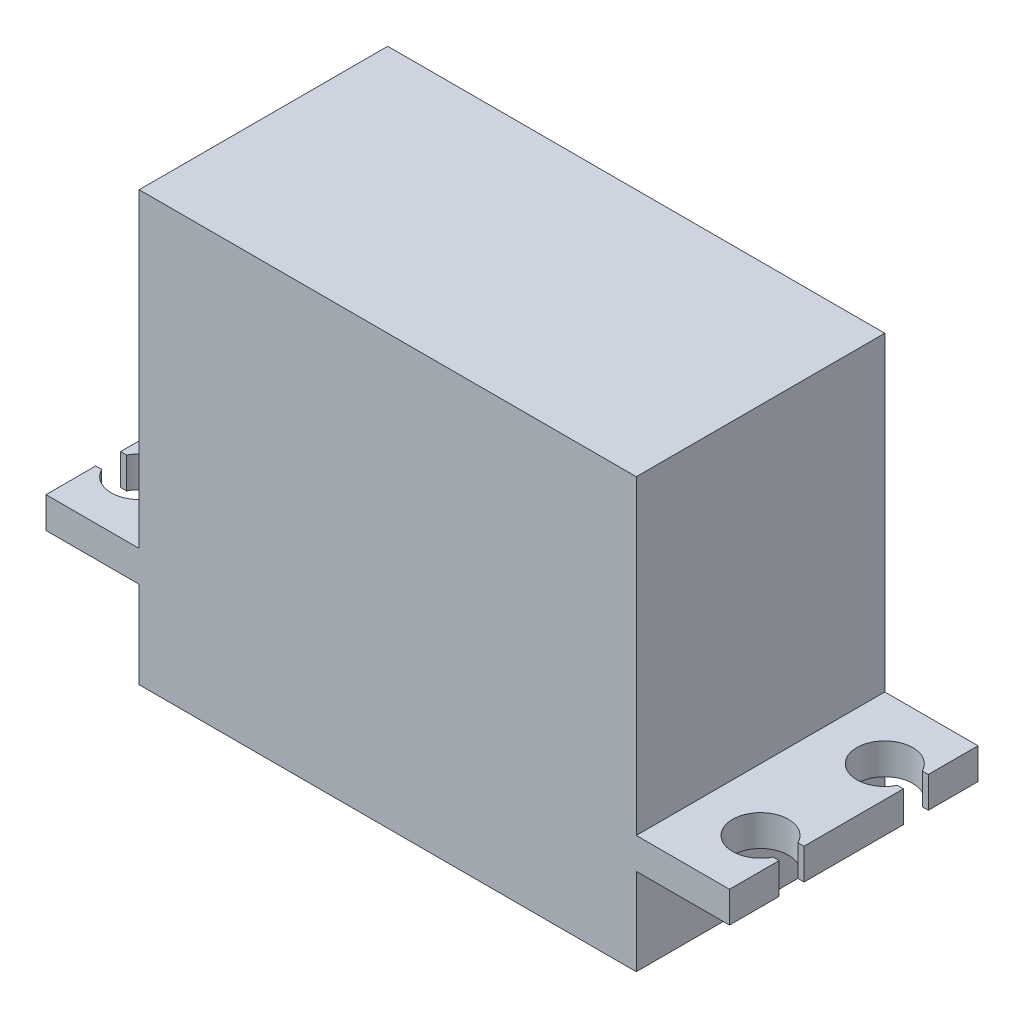
ISO-10303-21;
HEADER;
FILE_DESCRIPTION(('STEP AP214'),'2;1');
FILE_NAME('part.step','',(''),(''),'','','');
FILE_SCHEMA(('AUTOMOTIVE_DESIGN { 1 0 10303 214 1 1 1 1 }'));
ENDSEC;
DATA;
#1=APPLICATION_CONTEXT('core data for automotive mechanical design processes');
#2=APPLICATION_PROTOCOL_DEFINITION('international standard','automotive_design',2000,#1);
#3=PRODUCT_CONTEXT('',#1,'mechanical');
#4=PRODUCT('Part','Part','',(#3));
#5=PRODUCT_RELATED_PRODUCT_CATEGORY('part','',(#4));
#6=PRODUCT_DEFINITION_FORMATION('','',#4);
#7=PRODUCT_DEFINITION_CONTEXT('part definition',#1,'design');
#8=PRODUCT_DEFINITION('design','',#6,#7);
#9=PRODUCT_DEFINITION_SHAPE('','',#8);
#10=(LENGTH_UNIT() NAMED_UNIT(*) SI_UNIT(.MILLI.,.METRE.));
#11=(NAMED_UNIT(*) PLANE_ANGLE_UNIT() SI_UNIT($,.RADIAN.));
#12=(NAMED_UNIT(*) SI_UNIT($,.STERADIAN.) SOLID_ANGLE_UNIT());
#13=UNCERTAINTY_MEASURE_WITH_UNIT(LENGTH_MEASURE(1.E-05),#10,'distance_accuracy_value','');
#14=(GEOMETRIC_REPRESENTATION_CONTEXT(3) GLOBAL_UNCERTAINTY_ASSIGNED_CONTEXT((#13)) GLOBAL_UNIT_ASSIGNED_CONTEXT((#10,
#11,#12)) REPRESENTATION_CONTEXT('',''));
#15=CARTESIAN_POINT('',(0.,0.,0.));
#16=DIRECTION('',(0.,0.,1.));
#17=DIRECTION('',(1.,0.,0.));
#18=AXIS2_PLACEMENT_3D('',#15,#16,#17);
#19=CARTESIAN_POINT('',(0.,-9.5,-10.));
#20=DIRECTION('',(1.,0.,0.));
#21=DIRECTION('',(0.,0.,-1.));
#22=AXIS2_PLACEMENT_3D('',#19,#20,#21);
#23=PLANE('',#22);
#24=DIRECTION('',(0.,1.,0.));
#25=VECTOR('',#24,1.);
#26=CARTESIAN_POINT('',(0.,-9.5,-10.));
#27=LINE('',#26,#25);
#28=CARTESIAN_POINT('',(0.,-9.5,-10.));
#29=VERTEX_POINT('',#28);
#30=CARTESIAN_POINT('',(0.,-2.5,-9.99999999999999));
#31=VERTEX_POINT('',#30);
#32=EDGE_CURVE('E435',#29,#31,#27,.T.);
#33=ORIENTED_EDGE('',*,*,#32,.T.);
#34=DIRECTION('',(0.,0.,1.));
#35=VECTOR('',#34,1.);
#36=CARTESIAN_POINT('',(0.,-2.5,-9.99999999999999));
#37=LINE('',#36,#35);
#38=CARTESIAN_POINT('',(0.,-2.5,10.));
#39=VERTEX_POINT('',#38);
#40=EDGE_CURVE('E268',#31,#39,#37,.T.);
#41=ORIENTED_EDGE('',*,*,#40,.T.);
#42=DIRECTION('',(0.,1.,0.));
#43=VECTOR('',#42,1.);
#44=CARTESIAN_POINT('',(0.,-9.5,10.));
#45=LINE('',#44,#43);
#46=CARTESIAN_POINT('',(0.,-9.5,10.));
#47=VERTEX_POINT('',#46);
#48=EDGE_CURVE('E439',#47,#39,#45,.T.);
#49=ORIENTED_EDGE('',*,*,#48,.F.);
#50=DIRECTION('',(0.,0.,-1.));
#51=VECTOR('',#50,1.);
#52=CARTESIAN_POINT('',(0.,-9.5,-10.));
#53=LINE('',#52,#51);
#54=EDGE_CURVE('E425',#47,#29,#53,.T.);
#55=ORIENTED_EDGE('',*,*,#54,.T.);
#56=EDGE_LOOP('',(#33,#41,#49,#55));
#57=FACE_BOUND('',#56,.T.);
#58=ADVANCED_FACE('F32',(#57),#23,.T.);
#59=CARTESIAN_POINT('',(-40.,-9.5,-9.99999999999999));
#60=DIRECTION('',(-1.,0.,0.));
#61=DIRECTION('',(0.,0.,1.));
#62=AXIS2_PLACEMENT_3D('',#59,#60,#61);
#63=PLANE('',#62);
#64=DIRECTION('',(0.,1.,0.));
#65=VECTOR('',#64,1.);
#66=CARTESIAN_POINT('',(-40.,-9.5,10.));
#67=LINE('',#66,#65);
#68=CARTESIAN_POINT('',(-40.,-9.5,10.));
#69=VERTEX_POINT('',#68);
#70=CARTESIAN_POINT('',(-40.,-2.5,10.));
#71=VERTEX_POINT('',#70);
#72=EDGE_CURVE('E442',#69,#71,#67,.T.);
#73=ORIENTED_EDGE('',*,*,#72,.T.);
#74=DIRECTION('',(0.,0.,-1.));
#75=VECTOR('',#74,1.);
#76=CARTESIAN_POINT('',(-40.,-2.5,-9.99999999999999));
#77=LINE('',#76,#75);
#78=CARTESIAN_POINT('',(-40.,-2.5,-9.99999999999999));
#79=VERTEX_POINT('',#78);
#80=EDGE_CURVE('E320',#71,#79,#77,.T.);
#81=ORIENTED_EDGE('',*,*,#80,.T.);
#82=DIRECTION('',(0.,1.,0.));
#83=VECTOR('',#82,1.);
#84=CARTESIAN_POINT('',(-40.,-9.5,-9.99999999999999));
#85=LINE('',#84,#83);
#86=CARTESIAN_POINT('',(-40.,-9.5,-9.99999999999999));
#87=VERTEX_POINT('',#86);
#88=EDGE_CURVE('E40',#87,#79,#85,.T.);
#89=ORIENTED_EDGE('',*,*,#88,.F.);
#90=DIRECTION('',(0.,0.,1.));
#91=VECTOR('',#90,1.);
#92=CARTESIAN_POINT('',(-40.,-9.5,-9.99999999999999));
#93=LINE('',#92,#91);
#94=EDGE_CURVE('E419',#87,#69,#93,.T.);
#95=ORIENTED_EDGE('',*,*,#94,.T.);
#96=EDGE_LOOP('',(#73,#81,#89,#95));
#97=FACE_BOUND('',#96,.T.);
#98=ADVANCED_FACE('F473',(#97),#63,.T.);
#99=DIRECTION('',(0.,0.,-1.));
#100=VECTOR('',#99,1.);
#101=CARTESIAN_POINT('',(-40.,0.,-9.99999999999999));
#102=LINE('',#101,#100);
#103=CARTESIAN_POINT('',(-40.,0.,10.));
#104=VERTEX_POINT('',#103);
#105=CARTESIAN_POINT('',(-40.,0.,-9.99999999999999));
#106=VERTEX_POINT('',#105);
#107=EDGE_CURVE('E304',#104,#106,#102,.T.);
#108=ORIENTED_EDGE('',*,*,#107,.F.);
#109=CARTESIAN_POINT('',(-40.,25.,10.));
#110=VERTEX_POINT('',#109);
#111=EDGE_CURVE('E431',#104,#110,#67,.T.);
#112=ORIENTED_EDGE('',*,*,#111,.T.);
#113=DIRECTION('',(0.,0.,1.));
#114=VECTOR('',#113,1.);
#115=CARTESIAN_POINT('',(-40.,25.,-9.99999999999999));
#116=LINE('',#115,#114);
#117=CARTESIAN_POINT('',(-40.,25.,-9.99999999999999));
#118=VERTEX_POINT('',#117);
#119=EDGE_CURVE('E390',#118,#110,#116,.T.);
#120=ORIENTED_EDGE('',*,*,#119,.F.);
#121=EDGE_CURVE('E434',#106,#118,#85,.T.);
#122=ORIENTED_EDGE('',*,*,#121,.F.);
#123=EDGE_LOOP('',(#108,#112,#120,#122));
#124=FACE_BOUND('',#123,.T.);
#125=ADVANCED_FACE('F34',(#124),#63,.T.);
#126=CARTESIAN_POINT('',(-40.,-9.5,-9.99999999999999));
#127=DIRECTION('',(0.,0.,-1.));
#128=DIRECTION('',(-1.,0.,0.));
#129=AXIS2_PLACEMENT_3D('',#126,#127,#128);
#130=PLANE('',#129);
#131=ORIENTED_EDGE('',*,*,#88,.T.);
#132=DIRECTION('',(-1.,0.,0.));
#133=VECTOR('',#132,1.);
#134=CARTESIAN_POINT('',(-40.,-2.5,-9.99999999999999));
#135=LINE('',#134,#133);
#136=CARTESIAN_POINT('',(-47.5,-2.5,-9.99999999999999));
#137=VERTEX_POINT('',#136);
#138=EDGE_CURVE('E55',#79,#137,#135,.T.);
#139=ORIENTED_EDGE('',*,*,#138,.T.);
#140=DIRECTION('',(0.,1.,0.));
#141=VECTOR('',#140,1.);
#142=CARTESIAN_POINT('',(-47.5,-2.5,-9.99999999999999));
#143=LINE('',#142,#141);
#144=CARTESIAN_POINT('',(-47.5,0.,-9.99999999999999));
#145=VERTEX_POINT('',#144);
#146=EDGE_CURVE('E354',#137,#145,#143,.T.);
#147=ORIENTED_EDGE('',*,*,#146,.T.);
#148=DIRECTION('',(-1.,0.,0.));
#149=VECTOR('',#148,1.);
#150=CARTESIAN_POINT('',(-40.,0.,-9.99999999999999));
#151=LINE('',#150,#149);
#152=EDGE_CURVE('E357',#106,#145,#151,.T.);
#153=ORIENTED_EDGE('',*,*,#152,.F.);
#154=ORIENTED_EDGE('',*,*,#121,.T.);
#155=DIRECTION('',(-1.,0.,0.));
#156=VECTOR('',#155,1.);
#157=CARTESIAN_POINT('',(-40.,25.,-9.99999999999999));
#158=LINE('',#157,#156);
#159=CARTESIAN_POINT('',(0.,25.,-10.));
#160=VERTEX_POINT('',#159);
#161=EDGE_CURVE('E416',#160,#118,#158,.T.);
#162=ORIENTED_EDGE('',*,*,#161,.F.);
#163=CARTESIAN_POINT('',(0.,0.,-9.99999999999999));
#164=VERTEX_POINT('',#163);
#165=EDGE_CURVE('E438',#164,#160,#27,.T.);
#166=ORIENTED_EDGE('',*,*,#165,.F.);
#167=DIRECTION('',(-1.,0.,0.));
#168=VECTOR('',#167,1.);
#169=CARTESIAN_POINT('',(0.,0.,-9.99999999999999));
#170=LINE('',#169,#168);
#171=CARTESIAN_POINT('',(7.5,0.,-9.99999999999999));
#172=VERTEX_POINT('',#171);
#173=EDGE_CURVE('E293',#172,#164,#170,.T.);
#174=ORIENTED_EDGE('',*,*,#173,.F.);
#175=DIRECTION('',(0.,1.,0.));
#176=VECTOR('',#175,1.);
#177=CARTESIAN_POINT('',(7.5,-2.5,-9.99999999999999));
#178=LINE('',#177,#176);
#179=CARTESIAN_POINT('',(7.5,-2.5,-9.99999999999999));
#180=VERTEX_POINT('',#179);
#181=EDGE_CURVE('E309',#180,#172,#178,.T.);
#182=ORIENTED_EDGE('',*,*,#181,.F.);
#183=DIRECTION('',(-1.,0.,0.));
#184=VECTOR('',#183,1.);
#185=CARTESIAN_POINT('',(0.,-2.5,-9.99999999999999));
#186=LINE('',#185,#184);
#187=EDGE_CURVE('E265',#180,#31,#186,.T.);
#188=ORIENTED_EDGE('',*,*,#187,.T.);
#189=ORIENTED_EDGE('',*,*,#32,.F.);
#190=DIRECTION('',(-1.,0.,0.));
#191=VECTOR('',#190,1.);
#192=CARTESIAN_POINT('',(-40.,-9.5,-9.99999999999999));
#193=LINE('',#192,#191);
#194=EDGE_CURVE('E428',#29,#87,#193,.T.);
#195=ORIENTED_EDGE('',*,*,#194,.T.);
#196=EDGE_LOOP('',(#131,#139,#147,#153,#154,#162,#166,#174,#182,#188,#189,#195));
#197=FACE_BOUND('',#196,.T.);
#198=ADVANCED_FACE('F461',(#197),#130,.T.);
#199=DIRECTION('',(0.,0.,1.));
#200=VECTOR('',#199,1.);
#201=CARTESIAN_POINT('',(0.,0.,-9.99999999999999));
#202=LINE('',#201,#200);
#203=CARTESIAN_POINT('',(0.,0.,10.));
#204=VERTEX_POINT('',#203);
#205=EDGE_CURVE('E295',#164,#204,#202,.T.);
#206=ORIENTED_EDGE('',*,*,#205,.F.);
#207=ORIENTED_EDGE('',*,*,#165,.T.);
#208=DIRECTION('',(0.,0.,-1.));
#209=VECTOR('',#208,1.);
#210=CARTESIAN_POINT('',(0.,25.,-10.));
#211=LINE('',#210,#209);
#212=CARTESIAN_POINT('',(0.,25.,10.));
#213=VERTEX_POINT('',#212);
#214=EDGE_CURVE('E413',#213,#160,#211,.T.);
#215=ORIENTED_EDGE('',*,*,#214,.F.);
#216=EDGE_CURVE('E441',#204,#213,#45,.T.);
#217=ORIENTED_EDGE('',*,*,#216,.F.);
#218=EDGE_LOOP('',(#206,#207,#215,#217));
#219=FACE_BOUND('',#218,.T.);
#220=ADVANCED_FACE('F510',(#219),#23,.T.);
#221=CARTESIAN_POINT('',(-40.,-9.5,10.));
#222=DIRECTION('',(0.,0.,1.));
#223=DIRECTION('',(1.,0.,0.));
#224=AXIS2_PLACEMENT_3D('',#221,#222,#223);
#225=PLANE('',#224);
#226=ORIENTED_EDGE('',*,*,#48,.T.);
#227=DIRECTION('',(1.,0.,0.));
#228=VECTOR('',#227,1.);
#229=CARTESIAN_POINT('',(0.,-2.5,10.));
#230=LINE('',#229,#228);
#231=CARTESIAN_POINT('',(7.5,-2.5,10.));
#232=VERTEX_POINT('',#231);
#233=EDGE_CURVE('E47',#39,#232,#230,.T.);
#234=ORIENTED_EDGE('',*,*,#233,.T.);
#235=DIRECTION('',(0.,1.,0.));
#236=VECTOR('',#235,1.);
#237=CARTESIAN_POINT('',(7.5,-2.5,10.));
#238=LINE('',#237,#236);
#239=CARTESIAN_POINT('',(7.5,0.,10.));
#240=VERTEX_POINT('',#239);
#241=EDGE_CURVE('E307',#232,#240,#238,.T.);
#242=ORIENTED_EDGE('',*,*,#241,.T.);
#243=DIRECTION('',(1.,0.,0.));
#244=VECTOR('',#243,1.);
#245=CARTESIAN_POINT('',(0.,0.,10.));
#246=LINE('',#245,#244);
#247=EDGE_CURVE('E298',#204,#240,#246,.T.);
#248=ORIENTED_EDGE('',*,*,#247,.F.);
#249=ORIENTED_EDGE('',*,*,#216,.T.);
#250=DIRECTION('',(1.,0.,0.));
#251=VECTOR('',#250,1.);
#252=CARTESIAN_POINT('',(-40.,25.,10.));
#253=LINE('',#252,#251);
#254=EDGE_CURVE('E410',#110,#213,#253,.T.);
#255=ORIENTED_EDGE('',*,*,#254,.F.);
#256=ORIENTED_EDGE('',*,*,#111,.F.);
#257=DIRECTION('',(1.,0.,0.));
#258=VECTOR('',#257,1.);
#259=CARTESIAN_POINT('',(-40.,0.,10.));
#260=LINE('',#259,#258);
#261=CARTESIAN_POINT('',(-47.5,0.,10.));
#262=VERTEX_POINT('',#261);
#263=EDGE_CURVE('E322',#262,#104,#260,.T.);
#264=ORIENTED_EDGE('',*,*,#263,.F.);
#265=DIRECTION('',(0.,1.,0.));
#266=VECTOR('',#265,1.);
#267=CARTESIAN_POINT('',(-47.5,-2.5,10.));
#268=LINE('',#267,#266);
#269=CARTESIAN_POINT('',(-47.5,-2.5,10.));
#270=VERTEX_POINT('',#269);
#271=EDGE_CURVE('E388',#270,#262,#268,.T.);
#272=ORIENTED_EDGE('',*,*,#271,.F.);
#273=DIRECTION('',(1.,0.,0.));
#274=VECTOR('',#273,1.);
#275=CARTESIAN_POINT('',(-40.,-2.5,10.));
#276=LINE('',#275,#274);
#277=EDGE_CURVE('E351',#270,#71,#276,.T.);
#278=ORIENTED_EDGE('',*,*,#277,.T.);
#279=ORIENTED_EDGE('',*,*,#72,.F.);
#280=DIRECTION('',(1.,0.,0.));
#281=VECTOR('',#280,1.);
#282=CARTESIAN_POINT('',(-40.,-9.5,10.));
#283=LINE('',#282,#281);
#284=EDGE_CURVE('E422',#69,#47,#283,.T.);
#285=ORIENTED_EDGE('',*,*,#284,.T.);
#286=EDGE_LOOP('',(#226,#234,#242,#248,#249,#255,#256,#264,#272,#278,#279,#285));
#287=FACE_BOUND('',#286,.T.);
#288=ADVANCED_FACE('F453',(#287),#225,.T.);
#289=CARTESIAN_POINT('',(0.,-9.5,0.));
#290=DIRECTION('',(0.,1.,0.));
#291=DIRECTION('',(0.,0.,1.));
#292=AXIS2_PLACEMENT_3D('',#289,#290,#291);
#293=PLANE('',#292);
#294=CARTESIAN_POINT('',(-28.5,-9.5,0.));
#295=DIRECTION('',(0.,1.,0.));
#296=DIRECTION('',(0.,0.,1.));
#297=AXIS2_PLACEMENT_3D('',#294,#295,#296);
#298=CIRCLE('',#297,3.);
#299=CARTESIAN_POINT('',(-28.5,-9.5,3.));
#300=VERTEX_POINT('',#299);
#301=EDGE_CURVE('E11',#300,#300,#298,.F.);
#302=ORIENTED_EDGE('',*,*,#301,.F.);
#303=EDGE_LOOP('',(#302));
#304=FACE_BOUND('',#303,.T.);
#305=ORIENTED_EDGE('',*,*,#94,.F.);
#306=ORIENTED_EDGE('',*,*,#194,.F.);
#307=ORIENTED_EDGE('',*,*,#54,.F.);
#308=ORIENTED_EDGE('',*,*,#284,.F.);
#309=EDGE_LOOP('',(#305,#306,#307,#308));
#310=FACE_BOUND('',#309,.T.);
#311=ADVANCED_FACE('F478',(#304,#310),#293,.F.);
#312=CARTESIAN_POINT('',(0.,25.,0.));
#313=DIRECTION('',(0.,1.,0.));
#314=DIRECTION('',(0.,0.,1.));
#315=AXIS2_PLACEMENT_3D('',#312,#313,#314);
#316=PLANE('',#315);
#317=ORIENTED_EDGE('',*,*,#119,.T.);
#318=ORIENTED_EDGE('',*,*,#254,.T.);
#319=ORIENTED_EDGE('',*,*,#214,.T.);
#320=ORIENTED_EDGE('',*,*,#161,.T.);
#321=EDGE_LOOP('',(#317,#318,#319,#320));
#322=FACE_BOUND('',#321,.T.);
#323=ADVANCED_FACE('F457',(#322),#316,.T.);
#324=CARTESIAN_POINT('',(-47.5,-2.5,10.));
#325=DIRECTION('',(-1.,0.,0.));
#326=DIRECTION('',(0.,0.,1.));
#327=AXIS2_PLACEMENT_3D('',#324,#325,#326);
#328=PLANE('',#327);
#329=DIRECTION('',(0.,0.,1.));
#330=VECTOR('',#329,1.);
#331=CARTESIAN_POINT('',(-47.5,0.,10.));
#332=LINE('',#331,#330);
#333=CARTESIAN_POINT('',(-47.5,0.,6.00000000000001));
#334=VERTEX_POINT('',#333);
#335=EDGE_CURVE('E384',#334,#262,#332,.T.);
#336=ORIENTED_EDGE('',*,*,#335,.F.);
#337=DIRECTION('',(0.,1.,0.));
#338=VECTOR('',#337,1.);
#339=CARTESIAN_POINT('',(-47.5,-2.5,6.00000000000001));
#340=LINE('',#339,#338);
#341=CARTESIAN_POINT('',(-47.5,-2.5,6.00000000000001));
#342=VERTEX_POINT('',#341);
#343=EDGE_CURVE('E391',#342,#334,#340,.T.);
#344=ORIENTED_EDGE('',*,*,#343,.F.);
#345=DIRECTION('',(0.,0.,1.));
#346=VECTOR('',#345,1.);
#347=CARTESIAN_POINT('',(-47.5,-2.5,10.));
#348=LINE('',#347,#346);
#349=EDGE_CURVE('E348',#342,#270,#348,.T.);
#350=ORIENTED_EDGE('',*,*,#349,.T.);
#351=ORIENTED_EDGE('',*,*,#271,.T.);
#352=EDGE_LOOP('',(#336,#344,#350,#351));
#353=FACE_BOUND('',#352,.T.);
#354=ADVANCED_FACE('F470',(#353),#328,.T.);
#355=CARTESIAN_POINT('',(-47.0155644370746,-2.5,6.00000000000001));
#356=DIRECTION('',(0.,0.,-1.));
#357=DIRECTION('',(-1.,0.,0.));
#358=AXIS2_PLACEMENT_3D('',#355,#356,#357);
#359=PLANE('',#358);
#360=DIRECTION('',(-1.,0.,0.));
#361=VECTOR('',#360,1.);
#362=CARTESIAN_POINT('',(-47.0155644370746,0.,6.00000000000001));
#363=LINE('',#362,#361);
#364=CARTESIAN_POINT('',(-47.0155644370746,0.,6.00000000000001));
#365=VERTEX_POINT('',#364);
#366=EDGE_CURVE('E381',#365,#334,#363,.T.);
#367=ORIENTED_EDGE('',*,*,#366,.F.);
#368=DIRECTION('',(0.,1.,0.));
#369=VECTOR('',#368,1.);
#370=CARTESIAN_POINT('',(-47.0155644370746,-2.5,6.00000000000001));
#371=LINE('',#370,#369);
#372=CARTESIAN_POINT('',(-47.0155644370746,-2.5,6.00000000000001));
#373=VERTEX_POINT('',#372);
#374=EDGE_CURVE('E393',#373,#365,#371,.T.);
#375=ORIENTED_EDGE('',*,*,#374,.F.);
#376=DIRECTION('',(-1.,0.,0.));
#377=VECTOR('',#376,1.);
#378=CARTESIAN_POINT('',(-47.0155644370746,-2.5,6.00000000000001));
#379=LINE('',#378,#377);
#380=EDGE_CURVE('E345',#373,#342,#379,.T.);
#381=ORIENTED_EDGE('',*,*,#380,.T.);
#382=ORIENTED_EDGE('',*,*,#343,.T.);
#383=EDGE_LOOP('',(#367,#375,#381,#382));
#384=FACE_BOUND('',#383,.T.);
#385=ADVANCED_FACE('F555',(#384),#359,.T.);
#386=CARTESIAN_POINT('',(-45.,-2.5,5.00000000000001));
#387=DIRECTION('',(0.,1.,0.));
#388=DIRECTION('',(0.,0.,1.));
#389=AXIS2_PLACEMENT_3D('',#386,#387,#388);
#390=CYLINDRICAL_SURFACE('',#389,2.25);
#391=CARTESIAN_POINT('',(-45.,0.,5.00000000000001));
#392=DIRECTION('',(0.,-1.,0.));
#393=DIRECTION('',(0.,0.,1.));
#394=AXIS2_PLACEMENT_3D('',#391,#392,#393);
#395=CIRCLE('',#394,2.25);
#396=CARTESIAN_POINT('',(-47.0155644370746,0.,4.00000000000001));
#397=VERTEX_POINT('',#396);
#398=EDGE_CURVE('E378',#397,#365,#395,.T.);
#399=ORIENTED_EDGE('',*,*,#398,.F.);
#400=DIRECTION('',(0.,1.,0.));
#401=VECTOR('',#400,1.);
#402=CARTESIAN_POINT('',(-47.0155644370746,-2.5,4.00000000000001));
#403=LINE('',#402,#401);
#404=CARTESIAN_POINT('',(-47.0155644370746,-2.5,4.00000000000001));
#405=VERTEX_POINT('',#404);
#406=EDGE_CURVE('E395',#405,#397,#403,.T.);
#407=ORIENTED_EDGE('',*,*,#406,.F.);
#408=CARTESIAN_POINT('',(-45.,-2.5,5.00000000000001));
#409=DIRECTION('',(0.,-1.,0.));
#410=DIRECTION('',(0.,0.,1.));
#411=AXIS2_PLACEMENT_3D('',#408,#409,#410);
#412=CIRCLE('',#411,2.25);
#413=EDGE_CURVE('E342',#405,#373,#412,.T.);
#414=ORIENTED_EDGE('',*,*,#413,.T.);
#415=ORIENTED_EDGE('',*,*,#374,.T.);
#416=EDGE_LOOP('',(#399,#407,#414,#415));
#417=FACE_BOUND('',#416,.T.);
#418=ADVANCED_FACE('F565',(#417),#390,.F.);
#419=CARTESIAN_POINT('',(-47.0155644370746,-2.5,4.00000000000001));
#420=DIRECTION('',(0.,0.,1.));
#421=DIRECTION('',(1.,0.,0.));
#422=AXIS2_PLACEMENT_3D('',#419,#420,#421);
#423=PLANE('',#422);
#424=DIRECTION('',(1.,0.,0.));
#425=VECTOR('',#424,1.);
#426=CARTESIAN_POINT('',(-47.0155644370746,0.,4.00000000000001));
#427=LINE('',#426,#425);
#428=CARTESIAN_POINT('',(-47.5,0.,4.00000000000001));
#429=VERTEX_POINT('',#428);
#430=EDGE_CURVE('E375',#429,#397,#427,.T.);
#431=ORIENTED_EDGE('',*,*,#430,.F.);
#432=DIRECTION('',(0.,1.,0.));
#433=VECTOR('',#432,1.);
#434=CARTESIAN_POINT('',(-47.5,-2.5,4.00000000000001));
#435=LINE('',#434,#433);
#436=CARTESIAN_POINT('',(-47.5,-2.5,4.00000000000001));
#437=VERTEX_POINT('',#436);
#438=EDGE_CURVE('E397',#437,#429,#435,.T.);
#439=ORIENTED_EDGE('',*,*,#438,.F.);
#440=DIRECTION('',(1.,0.,0.));
#441=VECTOR('',#440,1.);
#442=CARTESIAN_POINT('',(-47.0155644370746,-2.5,4.00000000000001));
#443=LINE('',#442,#441);
#444=EDGE_CURVE('E339',#437,#405,#443,.T.);
#445=ORIENTED_EDGE('',*,*,#444,.T.);
#446=ORIENTED_EDGE('',*,*,#406,.T.);
#447=EDGE_LOOP('',(#431,#439,#445,#446));
#448=FACE_BOUND('',#447,.T.);
#449=ADVANCED_FACE('F575',(#448),#423,.T.);
#450=CARTESIAN_POINT('',(-47.5,-2.5,4.00000000000001));
#451=DIRECTION('',(-1.,0.,0.));
#452=DIRECTION('',(0.,0.,1.));
#453=AXIS2_PLACEMENT_3D('',#450,#451,#452);
#454=PLANE('',#453);
#455=DIRECTION('',(0.,0.,1.));
#456=VECTOR('',#455,1.);
#457=CARTESIAN_POINT('',(-47.5,0.,4.00000000000001));
#458=LINE('',#457,#456);
#459=CARTESIAN_POINT('',(-47.5,0.,-3.99999999999999));
#460=VERTEX_POINT('',#459);
#461=EDGE_CURVE('E372',#460,#429,#458,.T.);
#462=ORIENTED_EDGE('',*,*,#461,.F.);
#463=DIRECTION('',(0.,1.,0.));
#464=VECTOR('',#463,1.);
#465=CARTESIAN_POINT('',(-47.5,-2.5,-3.99999999999999));
#466=LINE('',#465,#464);
#467=CARTESIAN_POINT('',(-47.5,-2.5,-3.99999999999999));
#468=VERTEX_POINT('',#467);
#469=EDGE_CURVE('E399',#468,#460,#466,.T.);
#470=ORIENTED_EDGE('',*,*,#469,.F.);
#471=DIRECTION('',(0.,0.,1.));
#472=VECTOR('',#471,1.);
#473=CARTESIAN_POINT('',(-47.5,-2.5,4.00000000000001));
#474=LINE('',#473,#472);
#475=EDGE_CURVE('E336',#468,#437,#474,.T.);
#476=ORIENTED_EDGE('',*,*,#475,.T.);
#477=ORIENTED_EDGE('',*,*,#438,.T.);
#478=EDGE_LOOP('',(#462,#470,#476,#477));
#479=FACE_BOUND('',#478,.T.);
#480=ADVANCED_FACE('F585',(#479),#454,.T.);
#481=CARTESIAN_POINT('',(-47.0155644370746,-2.5,-3.99999999999999));
#482=DIRECTION('',(0.,0.,-1.));
#483=DIRECTION('',(-1.,0.,0.));
#484=AXIS2_PLACEMENT_3D('',#481,#482,#483);
#485=PLANE('',#484);
#486=DIRECTION('',(-1.,0.,0.));
#487=VECTOR('',#486,1.);
#488=CARTESIAN_POINT('',(-47.0155644370746,0.,-3.99999999999999));
#489=LINE('',#488,#487);
#490=CARTESIAN_POINT('',(-47.0155644370746,0.,-3.99999999999999));
#491=VERTEX_POINT('',#490);
#492=EDGE_CURVE('E369',#491,#460,#489,.T.);
#493=ORIENTED_EDGE('',*,*,#492,.F.);
#494=DIRECTION('',(0.,1.,0.));
#495=VECTOR('',#494,1.);
#496=CARTESIAN_POINT('',(-47.0155644370746,-2.5,-3.99999999999999));
#497=LINE('',#496,#495);
#498=CARTESIAN_POINT('',(-47.0155644370746,-2.5,-3.99999999999999));
#499=VERTEX_POINT('',#498);
#500=EDGE_CURVE('E401',#499,#491,#497,.T.);
#501=ORIENTED_EDGE('',*,*,#500,.F.);
#502=DIRECTION('',(-1.,0.,0.));
#503=VECTOR('',#502,1.);
#504=CARTESIAN_POINT('',(-47.0155644370746,-2.5,-3.99999999999999));
#505=LINE('',#504,#503);
#506=EDGE_CURVE('E333',#499,#468,#505,.T.);
#507=ORIENTED_EDGE('',*,*,#506,.T.);
#508=ORIENTED_EDGE('',*,*,#469,.T.);
#509=EDGE_LOOP('',(#493,#501,#507,#508));
#510=FACE_BOUND('',#509,.T.);
#511=ADVANCED_FACE('F595',(#510),#485,.T.);
#512=CARTESIAN_POINT('',(-45.,-2.5,-4.99999999999999));
#513=DIRECTION('',(0.,1.,0.));
#514=DIRECTION('',(0.,0.,1.));
#515=AXIS2_PLACEMENT_3D('',#512,#513,#514);
#516=CYLINDRICAL_SURFACE('',#515,2.25);
#517=CARTESIAN_POINT('',(-45.,0.,-4.99999999999999));
#518=DIRECTION('',(0.,-1.,0.));
#519=DIRECTION('',(0.,0.,1.));
#520=AXIS2_PLACEMENT_3D('',#517,#518,#519);
#521=CIRCLE('',#520,2.25);
#522=CARTESIAN_POINT('',(-47.0155644370746,0.,-6.));
#523=VERTEX_POINT('',#522);
#524=EDGE_CURVE('E366',#523,#491,#521,.T.);
#525=ORIENTED_EDGE('',*,*,#524,.F.);
#526=DIRECTION('',(0.,1.,0.));
#527=VECTOR('',#526,1.);
#528=CARTESIAN_POINT('',(-47.0155644370746,-2.5,-6.));
#529=LINE('',#528,#527);
#530=CARTESIAN_POINT('',(-47.0155644370746,-2.5,-6.));
#531=VERTEX_POINT('',#530);
#532=EDGE_CURVE('E403',#531,#523,#529,.T.);
#533=ORIENTED_EDGE('',*,*,#532,.F.);
#534=CARTESIAN_POINT('',(-45.,-2.5,-4.99999999999999));
#535=DIRECTION('',(0.,-1.,0.));
#536=DIRECTION('',(0.,0.,1.));
#537=AXIS2_PLACEMENT_3D('',#534,#535,#536);
#538=CIRCLE('',#537,2.25);
#539=EDGE_CURVE('E330',#531,#499,#538,.T.);
#540=ORIENTED_EDGE('',*,*,#539,.T.);
#541=ORIENTED_EDGE('',*,*,#500,.T.);
#542=EDGE_LOOP('',(#525,#533,#540,#541));
#543=FACE_BOUND('',#542,.T.);
#544=ADVANCED_FACE('F605',(#543),#516,.F.);
#545=CARTESIAN_POINT('',(-47.0155644370746,-2.5,-6.));
#546=DIRECTION('',(0.,0.,1.));
#547=DIRECTION('',(1.,0.,0.));
#548=AXIS2_PLACEMENT_3D('',#545,#546,#547);
#549=PLANE('',#548);
#550=DIRECTION('',(1.,0.,0.));
#551=VECTOR('',#550,1.);
#552=CARTESIAN_POINT('',(-47.0155644370746,0.,-6.));
#553=LINE('',#552,#551);
#554=CARTESIAN_POINT('',(-47.5,0.,-5.99999999999999));
#555=VERTEX_POINT('',#554);
#556=EDGE_CURVE('E363',#555,#523,#553,.T.);
#557=ORIENTED_EDGE('',*,*,#556,.F.);
#558=DIRECTION('',(0.,1.,0.));
#559=VECTOR('',#558,1.);
#560=CARTESIAN_POINT('',(-47.5,-2.5,-5.99999999999999));
#561=LINE('',#560,#559);
#562=CARTESIAN_POINT('',(-47.5,-2.5,-5.99999999999999));
#563=VERTEX_POINT('',#562);
#564=EDGE_CURVE('E405',#563,#555,#561,.T.);
#565=ORIENTED_EDGE('',*,*,#564,.F.);
#566=DIRECTION('',(1.,0.,0.));
#567=VECTOR('',#566,1.);
#568=CARTESIAN_POINT('',(-47.0155644370746,-2.5,-6.));
#569=LINE('',#568,#567);
#570=EDGE_CURVE('E327',#563,#531,#569,.T.);
#571=ORIENTED_EDGE('',*,*,#570,.T.);
#572=ORIENTED_EDGE('',*,*,#532,.T.);
#573=EDGE_LOOP('',(#557,#565,#571,#572));
#574=FACE_BOUND('',#573,.T.);
#575=ADVANCED_FACE('F615',(#574),#549,.T.);
#576=CARTESIAN_POINT('',(-47.5,-2.5,-5.99999999999999));
#577=DIRECTION('',(-1.,0.,0.));
#578=DIRECTION('',(0.,0.,1.));
#579=AXIS2_PLACEMENT_3D('',#576,#577,#578);
#580=PLANE('',#579);
#581=DIRECTION('',(0.,0.,1.));
#582=VECTOR('',#581,1.);
#583=CARTESIAN_POINT('',(-47.5,0.,-5.99999999999999));
#584=LINE('',#583,#582);
#585=EDGE_CURVE('E360',#145,#555,#584,.T.);
#586=ORIENTED_EDGE('',*,*,#585,.F.);
#587=ORIENTED_EDGE('',*,*,#146,.F.);
#588=DIRECTION('',(0.,0.,1.));
#589=VECTOR('',#588,1.);
#590=CARTESIAN_POINT('',(-47.5,-2.5,-5.99999999999999));
#591=LINE('',#590,#589);
#592=EDGE_CURVE('E324',#137,#563,#591,.T.);
#593=ORIENTED_EDGE('',*,*,#592,.T.);
#594=ORIENTED_EDGE('',*,*,#564,.T.);
#595=EDGE_LOOP('',(#586,#587,#593,#594));
#596=FACE_BOUND('',#595,.T.);
#597=ADVANCED_FACE('F625',(#596),#580,.T.);
#598=CARTESIAN_POINT('',(-45.,-2.5,5.00000000000001));
#599=DIRECTION('',(0.,1.,0.));
#600=DIRECTION('',(0.,0.,1.));
#601=AXIS2_PLACEMENT_3D('',#598,#599,#600);
#602=PLANE('',#601);
#603=ORIENTED_EDGE('',*,*,#80,.F.);
#604=ORIENTED_EDGE('',*,*,#277,.F.);
#605=ORIENTED_EDGE('',*,*,#349,.F.);
#606=ORIENTED_EDGE('',*,*,#380,.F.);
#607=ORIENTED_EDGE('',*,*,#413,.F.);
#608=ORIENTED_EDGE('',*,*,#444,.F.);
#609=ORIENTED_EDGE('',*,*,#475,.F.);
#610=ORIENTED_EDGE('',*,*,#506,.F.);
#611=ORIENTED_EDGE('',*,*,#539,.F.);
#612=ORIENTED_EDGE('',*,*,#570,.F.);
#613=ORIENTED_EDGE('',*,*,#592,.F.);
#614=ORIENTED_EDGE('',*,*,#138,.F.);
#615=EDGE_LOOP('',(#603,#604,#605,#606,#607,#608,#609,#610,#611,#612,#613,#614));
#616=FACE_BOUND('',#615,.T.);
#617=ADVANCED_FACE('F472',(#616),#602,.F.);
#618=CARTESIAN_POINT('',(-45.,0.,5.00000000000001));
#619=DIRECTION('',(0.,1.,0.));
#620=DIRECTION('',(0.,0.,1.));
#621=AXIS2_PLACEMENT_3D('',#618,#619,#620);
#622=PLANE('',#621);
#623=ORIENTED_EDGE('',*,*,#107,.T.);
#624=ORIENTED_EDGE('',*,*,#152,.T.);
#625=ORIENTED_EDGE('',*,*,#585,.T.);
#626=ORIENTED_EDGE('',*,*,#556,.T.);
#627=ORIENTED_EDGE('',*,*,#524,.T.);
#628=ORIENTED_EDGE('',*,*,#492,.T.);
#629=ORIENTED_EDGE('',*,*,#461,.T.);
#630=ORIENTED_EDGE('',*,*,#430,.T.);
#631=ORIENTED_EDGE('',*,*,#398,.T.);
#632=ORIENTED_EDGE('',*,*,#366,.T.);
#633=ORIENTED_EDGE('',*,*,#335,.T.);
#634=ORIENTED_EDGE('',*,*,#263,.T.);
#635=EDGE_LOOP('',(#623,#624,#625,#626,#627,#628,#629,#630,#631,#632,#633,#634));
#636=FACE_BOUND('',#635,.T.);
#637=ADVANCED_FACE('F465',(#636),#622,.T.);
#638=CARTESIAN_POINT('',(5.,-2.5,5.));
#639=DIRECTION('',(0.,1.,0.));
#640=DIRECTION('',(0.,0.,1.));
#641=AXIS2_PLACEMENT_3D('',#638,#639,#640);
#642=CYLINDRICAL_SURFACE('',#641,2.25);
#643=CARTESIAN_POINT('',(5.,0.,5.));
#644=DIRECTION('',(0.,-1.,0.));
#645=DIRECTION('',(0.,0.,-1.));
#646=AXIS2_PLACEMENT_3D('',#643,#644,#645);
#647=CIRCLE('',#646,2.25);
#648=CARTESIAN_POINT('',(7.01556443707464,0.,6.));
#649=VERTEX_POINT('',#648);
#650=CARTESIAN_POINT('',(7.01556443707464,0.,4.));
#651=VERTEX_POINT('',#650);
#652=EDGE_CURVE('E275',#649,#651,#647,.T.);
#653=ORIENTED_EDGE('',*,*,#652,.F.);
#654=DIRECTION('',(0.,1.,0.));
#655=VECTOR('',#654,1.);
#656=CARTESIAN_POINT('',(7.01556443707464,-2.5,6.));
#657=LINE('',#656,#655);
#658=CARTESIAN_POINT('',(7.01556443707464,-2.5,6.));
#659=VERTEX_POINT('',#658);
#660=EDGE_CURVE('E243',#659,#649,#657,.T.);
#661=ORIENTED_EDGE('',*,*,#660,.F.);
#662=CARTESIAN_POINT('',(5.,-2.5,5.));
#663=DIRECTION('',(0.,-1.,0.));
#664=DIRECTION('',(0.,0.,-1.));
#665=AXIS2_PLACEMENT_3D('',#662,#663,#664);
#666=CIRCLE('',#665,2.25);
#667=CARTESIAN_POINT('',(7.01556443707464,-2.5,4.));
#668=VERTEX_POINT('',#667);
#669=EDGE_CURVE('E236',#659,#668,#666,.T.);
#670=ORIENTED_EDGE('',*,*,#669,.T.);
#671=DIRECTION('',(0.,1.,0.));
#672=VECTOR('',#671,1.);
#673=CARTESIAN_POINT('',(7.01556443707464,-2.5,4.));
#674=LINE('',#673,#672);
#675=EDGE_CURVE('E219',#668,#651,#674,.T.);
#676=ORIENTED_EDGE('',*,*,#675,.T.);
#677=EDGE_LOOP('',(#653,#661,#670,#676));
#678=FACE_BOUND('',#677,.T.);
#679=ADVANCED_FACE('F242',(#678),#642,.F.);
#680=CARTESIAN_POINT('',(7.01556443707464,-2.5,6.));
#681=DIRECTION('',(0.,0.,-1.));
#682=DIRECTION('',(-1.,0.,0.));
#683=AXIS2_PLACEMENT_3D('',#680,#681,#682);
#684=PLANE('',#683);
#685=DIRECTION('',(-1.,0.,0.));
#686=VECTOR('',#685,1.);
#687=CARTESIAN_POINT('',(7.01556443707464,0.,6.));
#688=LINE('',#687,#686);
#689=CARTESIAN_POINT('',(7.5,0.,6.00000000000001));
#690=VERTEX_POINT('',#689);
#691=EDGE_CURVE('E244',#690,#649,#688,.T.);
#692=ORIENTED_EDGE('',*,*,#691,.F.);
#693=DIRECTION('',(0.,1.,0.));
#694=VECTOR('',#693,1.);
#695=CARTESIAN_POINT('',(7.5,-2.5,6.00000000000001));
#696=LINE('',#695,#694);
#697=CARTESIAN_POINT('',(7.5,-2.5,6.00000000000001));
#698=VERTEX_POINT('',#697);
#699=EDGE_CURVE('E305',#698,#690,#696,.T.);
#700=ORIENTED_EDGE('',*,*,#699,.F.);
#701=DIRECTION('',(-1.,0.,0.));
#702=VECTOR('',#701,1.);
#703=CARTESIAN_POINT('',(7.01556443707464,-2.5,6.));
#704=LINE('',#703,#702);
#705=EDGE_CURVE('E230',#698,#659,#704,.T.);
#706=ORIENTED_EDGE('',*,*,#705,.T.);
#707=ORIENTED_EDGE('',*,*,#660,.T.);
#708=EDGE_LOOP('',(#692,#700,#706,#707));
#709=FACE_BOUND('',#708,.T.);
#710=ADVANCED_FACE('F505',(#709),#684,.T.);
#711=CARTESIAN_POINT('',(7.5,-2.5,10.));
#712=DIRECTION('',(1.,0.,0.));
#713=DIRECTION('',(0.,0.,-1.));
#714=AXIS2_PLACEMENT_3D('',#711,#712,#713);
#715=PLANE('',#714);
#716=DIRECTION('',(0.,0.,-1.));
#717=VECTOR('',#716,1.);
#718=CARTESIAN_POINT('',(7.5,0.,10.));
#719=LINE('',#718,#717);
#720=EDGE_CURVE('E247',#240,#690,#719,.T.);
#721=ORIENTED_EDGE('',*,*,#720,.F.);
#722=ORIENTED_EDGE('',*,*,#241,.F.);
#723=DIRECTION('',(0.,0.,-1.));
#724=VECTOR('',#723,1.);
#725=CARTESIAN_POINT('',(7.5,-2.5,10.));
#726=LINE('',#725,#724);
#727=EDGE_CURVE('E271',#232,#698,#726,.T.);
#728=ORIENTED_EDGE('',*,*,#727,.T.);
#729=ORIENTED_EDGE('',*,*,#699,.T.);
#730=EDGE_LOOP('',(#721,#722,#728,#729));
#731=FACE_BOUND('',#730,.T.);
#732=ADVANCED_FACE('F507',(#731),#715,.T.);
#733=CARTESIAN_POINT('',(7.5,-2.5,-5.99999999999999));
#734=DIRECTION('',(1.,0.,0.));
#735=DIRECTION('',(0.,0.,-1.));
#736=AXIS2_PLACEMENT_3D('',#733,#734,#735);
#737=PLANE('',#736);
#738=DIRECTION('',(0.,0.,-1.));
#739=VECTOR('',#738,1.);
#740=CARTESIAN_POINT('',(7.5,0.,-5.99999999999999));
#741=LINE('',#740,#739);
#742=CARTESIAN_POINT('',(7.5,0.,-5.99999999999999));
#743=VERTEX_POINT('',#742);
#744=EDGE_CURVE('E290',#743,#172,#741,.T.);
#745=ORIENTED_EDGE('',*,*,#744,.F.);
#746=DIRECTION('',(0.,1.,0.));
#747=VECTOR('',#746,1.);
#748=CARTESIAN_POINT('',(7.5,-2.5,-5.99999999999999));
#749=LINE('',#748,#747);
#750=CARTESIAN_POINT('',(7.5,-2.5,-5.99999999999999));
#751=VERTEX_POINT('',#750);
#752=EDGE_CURVE('E311',#751,#743,#749,.T.);
#753=ORIENTED_EDGE('',*,*,#752,.F.);
#754=DIRECTION('',(0.,0.,-1.));
#755=VECTOR('',#754,1.);
#756=CARTESIAN_POINT('',(7.5,-2.5,-5.99999999999999));
#757=LINE('',#756,#755);
#758=EDGE_CURVE('E262',#751,#180,#757,.T.);
#759=ORIENTED_EDGE('',*,*,#758,.T.);
#760=ORIENTED_EDGE('',*,*,#181,.T.);
#761=EDGE_LOOP('',(#745,#753,#759,#760));
#762=FACE_BOUND('',#761,.T.);
#763=ADVANCED_FACE('F485',(#762),#737,.T.);
#764=CARTESIAN_POINT('',(7.01556443707464,-2.5,-6.));
#765=DIRECTION('',(0.,0.,1.));
#766=DIRECTION('',(1.,0.,0.));
#767=AXIS2_PLACEMENT_3D('',#764,#765,#766);
#768=PLANE('',#767);
#769=DIRECTION('',(1.,0.,0.));
#770=VECTOR('',#769,1.);
#771=CARTESIAN_POINT('',(7.01556443707464,0.,-6.));
#772=LINE('',#771,#770);
#773=CARTESIAN_POINT('',(7.01556443707464,0.,-6.));
#774=VERTEX_POINT('',#773);
#775=EDGE_CURVE('E287',#774,#743,#772,.T.);
#776=ORIENTED_EDGE('',*,*,#775,.F.);
#777=DIRECTION('',(0.,1.,0.));
#778=VECTOR('',#777,1.);
#779=CARTESIAN_POINT('',(7.01556443707464,-2.5,-6.));
#780=LINE('',#779,#778);
#781=CARTESIAN_POINT('',(7.01556443707464,-2.5,-6.));
#782=VERTEX_POINT('',#781);
#783=EDGE_CURVE('E313',#782,#774,#780,.T.);
#784=ORIENTED_EDGE('',*,*,#783,.F.);
#785=DIRECTION('',(1.,0.,0.));
#786=VECTOR('',#785,1.);
#787=CARTESIAN_POINT('',(7.01556443707464,-2.5,-6.));
#788=LINE('',#787,#786);
#789=EDGE_CURVE('E259',#782,#751,#788,.T.);
#790=ORIENTED_EDGE('',*,*,#789,.T.);
#791=ORIENTED_EDGE('',*,*,#752,.T.);
#792=EDGE_LOOP('',(#776,#784,#790,#791));
#793=FACE_BOUND('',#792,.T.);
#794=ADVANCED_FACE('F490',(#793),#768,.T.);
#795=CARTESIAN_POINT('',(5.,-2.5,-5.));
#796=DIRECTION('',(0.,1.,0.));
#797=DIRECTION('',(0.,0.,1.));
#798=AXIS2_PLACEMENT_3D('',#795,#796,#797);
#799=CYLINDRICAL_SURFACE('',#798,2.25);
#800=CARTESIAN_POINT('',(5.,0.,-5.));
#801=DIRECTION('',(0.,-1.,0.));
#802=DIRECTION('',(0.,0.,-1.));
#803=AXIS2_PLACEMENT_3D('',#800,#801,#802);
#804=CIRCLE('',#803,2.25);
#805=CARTESIAN_POINT('',(7.01556443707464,0.,-4.));
#806=VERTEX_POINT('',#805);
#807=EDGE_CURVE('E284',#806,#774,#804,.T.);
#808=ORIENTED_EDGE('',*,*,#807,.F.);
#809=DIRECTION('',(0.,1.,0.));
#810=VECTOR('',#809,1.);
#811=CARTESIAN_POINT('',(7.01556443707464,-2.5,-4.));
#812=LINE('',#811,#810);
#813=CARTESIAN_POINT('',(7.01556443707464,-2.5,-4.));
#814=VERTEX_POINT('',#813);
#815=EDGE_CURVE('E315',#814,#806,#812,.T.);
#816=ORIENTED_EDGE('',*,*,#815,.F.);
#817=CARTESIAN_POINT('',(5.,-2.5,-5.));
#818=DIRECTION('',(0.,-1.,0.));
#819=DIRECTION('',(0.,0.,-1.));
#820=AXIS2_PLACEMENT_3D('',#817,#818,#819);
#821=CIRCLE('',#820,2.25);
#822=EDGE_CURVE('E256',#814,#782,#821,.T.);
#823=ORIENTED_EDGE('',*,*,#822,.T.);
#824=ORIENTED_EDGE('',*,*,#783,.T.);
#825=EDGE_LOOP('',(#808,#816,#823,#824));
#826=FACE_BOUND('',#825,.T.);
#827=ADVANCED_FACE('F493',(#826),#799,.F.);
#828=CARTESIAN_POINT('',(7.01556443707464,-2.5,-4.));
#829=DIRECTION('',(0.,0.,-1.));
#830=DIRECTION('',(-1.,0.,0.));
#831=AXIS2_PLACEMENT_3D('',#828,#829,#830);
#832=PLANE('',#831);
#833=DIRECTION('',(-1.,0.,0.));
#834=VECTOR('',#833,1.);
#835=CARTESIAN_POINT('',(7.01556443707464,0.,-4.));
#836=LINE('',#835,#834);
#837=CARTESIAN_POINT('',(7.5,0.,-3.99999999999999));
#838=VERTEX_POINT('',#837);
#839=EDGE_CURVE('E281',#838,#806,#836,.T.);
#840=ORIENTED_EDGE('',*,*,#839,.F.);
#841=DIRECTION('',(0.,1.,0.));
#842=VECTOR('',#841,1.);
#843=CARTESIAN_POINT('',(7.5,-2.5,-3.99999999999999));
#844=LINE('',#843,#842);
#845=CARTESIAN_POINT('',(7.5,-2.5,-3.99999999999999));
#846=VERTEX_POINT('',#845);
#847=EDGE_CURVE('E317',#846,#838,#844,.T.);
#848=ORIENTED_EDGE('',*,*,#847,.F.);
#849=DIRECTION('',(-1.,0.,0.));
#850=VECTOR('',#849,1.);
#851=CARTESIAN_POINT('',(7.01556443707464,-2.5,-4.));
#852=LINE('',#851,#850);
#853=EDGE_CURVE('E253',#846,#814,#852,.T.);
#854=ORIENTED_EDGE('',*,*,#853,.T.);
#855=ORIENTED_EDGE('',*,*,#815,.T.);
#856=EDGE_LOOP('',(#840,#848,#854,#855));
#857=FACE_BOUND('',#856,.T.);
#858=ADVANCED_FACE('F496',(#857),#832,.T.);
#859=CARTESIAN_POINT('',(7.5,-2.5,4.00000000000001));
#860=DIRECTION('',(1.,0.,0.));
#861=DIRECTION('',(0.,0.,-1.));
#862=AXIS2_PLACEMENT_3D('',#859,#860,#861);
#863=PLANE('',#862);
#864=DIRECTION('',(0.,0.,-1.));
#865=VECTOR('',#864,1.);
#866=CARTESIAN_POINT('',(7.5,0.,4.00000000000001));
#867=LINE('',#866,#865);
#868=CARTESIAN_POINT('',(7.5,0.,4.00000000000001));
#869=VERTEX_POINT('',#868);
#870=EDGE_CURVE('E278',#869,#838,#867,.T.);
#871=ORIENTED_EDGE('',*,*,#870,.F.);
#872=DIRECTION('',(0.,1.,0.));
#873=VECTOR('',#872,1.);
#874=CARTESIAN_POINT('',(7.5,-2.5,4.00000000000001));
#875=LINE('',#874,#873);
#876=CARTESIAN_POINT('',(7.5,-2.5,4.00000000000001));
#877=VERTEX_POINT('',#876);
#878=EDGE_CURVE('E229',#877,#869,#875,.T.);
#879=ORIENTED_EDGE('',*,*,#878,.F.);
#880=DIRECTION('',(0.,0.,-1.));
#881=VECTOR('',#880,1.);
#882=CARTESIAN_POINT('',(7.5,-2.5,4.00000000000001));
#883=LINE('',#882,#881);
#884=EDGE_CURVE('E240',#877,#846,#883,.T.);
#885=ORIENTED_EDGE('',*,*,#884,.T.);
#886=ORIENTED_EDGE('',*,*,#847,.T.);
#887=EDGE_LOOP('',(#871,#879,#885,#886));
#888=FACE_BOUND('',#887,.T.);
#889=ADVANCED_FACE('F499',(#888),#863,.T.);
#890=CARTESIAN_POINT('',(7.01556443707464,-2.5,4.));
#891=DIRECTION('',(0.,0.,1.));
#892=DIRECTION('',(1.,0.,0.));
#893=AXIS2_PLACEMENT_3D('',#890,#891,#892);
#894=PLANE('',#893);
#895=DIRECTION('',(1.,0.,0.));
#896=VECTOR('',#895,1.);
#897=CARTESIAN_POINT('',(7.01556443707464,0.,4.));
#898=LINE('',#897,#896);
#899=EDGE_CURVE('E224',#651,#869,#898,.T.);
#900=ORIENTED_EDGE('',*,*,#899,.F.);
#901=ORIENTED_EDGE('',*,*,#675,.F.);
#902=DIRECTION('',(1.,0.,0.));
#903=VECTOR('',#902,1.);
#904=CARTESIAN_POINT('',(7.01556443707464,-2.5,4.));
#905=LINE('',#904,#903);
#906=EDGE_CURVE('E222',#668,#877,#905,.T.);
#907=ORIENTED_EDGE('',*,*,#906,.T.);
#908=ORIENTED_EDGE('',*,*,#878,.T.);
#909=EDGE_LOOP('',(#900,#901,#907,#908));
#910=FACE_BOUND('',#909,.T.);
#911=ADVANCED_FACE('F221',(#910),#894,.T.);
#912=CARTESIAN_POINT('',(5.,-2.5,5.));
#913=DIRECTION('',(0.,-1.,0.));
#914=DIRECTION('',(0.,0.,-1.));
#915=AXIS2_PLACEMENT_3D('',#912,#913,#914);
#916=PLANE('',#915);
#917=ORIENTED_EDGE('',*,*,#669,.F.);
#918=ORIENTED_EDGE('',*,*,#705,.F.);
#919=ORIENTED_EDGE('',*,*,#727,.F.);
#920=ORIENTED_EDGE('',*,*,#233,.F.);
#921=ORIENTED_EDGE('',*,*,#40,.F.);
#922=ORIENTED_EDGE('',*,*,#187,.F.);
#923=ORIENTED_EDGE('',*,*,#758,.F.);
#924=ORIENTED_EDGE('',*,*,#789,.F.);
#925=ORIENTED_EDGE('',*,*,#822,.F.);
#926=ORIENTED_EDGE('',*,*,#853,.F.);
#927=ORIENTED_EDGE('',*,*,#884,.F.);
#928=ORIENTED_EDGE('',*,*,#906,.F.);
#929=EDGE_LOOP('',(#917,#918,#919,#920,#921,#922,#923,#924,#925,#926,#927,#928));
#930=FACE_BOUND('',#929,.T.);
#931=ADVANCED_FACE('F234',(#930),#916,.T.);
#932=CARTESIAN_POINT('',(5.,0.,5.));
#933=DIRECTION('',(0.,-1.,0.));
#934=DIRECTION('',(0.,0.,-1.));
#935=AXIS2_PLACEMENT_3D('',#932,#933,#934);
#936=PLANE('',#935);
#937=ORIENTED_EDGE('',*,*,#652,.T.);
#938=ORIENTED_EDGE('',*,*,#899,.T.);
#939=ORIENTED_EDGE('',*,*,#870,.T.);
#940=ORIENTED_EDGE('',*,*,#839,.T.);
#941=ORIENTED_EDGE('',*,*,#807,.T.);
#942=ORIENTED_EDGE('',*,*,#775,.T.);
#943=ORIENTED_EDGE('',*,*,#744,.T.);
#944=ORIENTED_EDGE('',*,*,#173,.T.);
#945=ORIENTED_EDGE('',*,*,#205,.T.);
#946=ORIENTED_EDGE('',*,*,#247,.T.);
#947=ORIENTED_EDGE('',*,*,#720,.T.);
#948=ORIENTED_EDGE('',*,*,#691,.T.);
#949=EDGE_LOOP('',(#937,#938,#939,#940,#941,#942,#943,#944,#945,#946,#947,#948));
#950=FACE_BOUND('',#949,.T.);
#951=ADVANCED_FACE('F501',(#950),#936,.F.);
#952=CARTESIAN_POINT('',(-28.5,-15.5,0.));
#953=DIRECTION('',(0.,1.,0.));
#954=DIRECTION('',(0.,0.,1.));
#955=AXIS2_PLACEMENT_3D('',#952,#953,#954);
#956=CYLINDRICAL_SURFACE('',#955,3.);
#957=CARTESIAN_POINT('',(-28.5,-15.5,0.));
#958=DIRECTION('',(0.,-1.,0.));
#959=DIRECTION('',(0.,0.,-1.));
#960=AXIS2_PLACEMENT_3D('',#957,#958,#959);
#961=CIRCLE('',#960,3.);
#962=CARTESIAN_POINT('',(-28.5,-15.5,-3.));
#963=VERTEX_POINT('',#962);
#964=EDGE_CURVE('E250',#963,#963,#961,.T.);
#965=ORIENTED_EDGE('',*,*,#964,.F.);
#966=EDGE_LOOP('',(#965));
#967=FACE_BOUND('',#966,.T.);
#968=ORIENTED_EDGE('',*,*,#301,.T.);
#969=EDGE_LOOP('',(#968));
#970=FACE_BOUND('',#969,.T.);
#971=ADVANCED_FACE('F740',(#967,#970),#956,.T.);
#972=CARTESIAN_POINT('',(-28.5,-15.5,0.));
#973=DIRECTION('',(0.,-1.,0.));
#974=DIRECTION('',(0.,0.,-1.));
#975=AXIS2_PLACEMENT_3D('',#972,#973,#974);
#976=PLANE('',#975);
#977=ORIENTED_EDGE('',*,*,#964,.T.);
#978=EDGE_LOOP('',(#977));
#979=FACE_BOUND('',#978,.T.);
#980=ADVANCED_FACE('F758',(#979),#976,.T.);
#981=CLOSED_SHELL('',(#58,#98,#125,#198,#220,#288,#311,#323,#354,#385,#418,#449,#480,#511,#544,
#575,#597,#617,#637,#679,#710,#732,#763,#794,#827,#858,#889,#911,#931,#951,#971,#980));
#982=MANIFOLD_SOLID_BREP('B2',#981);
#983=ADVANCED_BREP_SHAPE_REPRESENTATION('',(#18,#982),#14);
#984=SHAPE_DEFINITION_REPRESENTATION(#9,#983);
ENDSEC;
END-ISO-10303-21;
